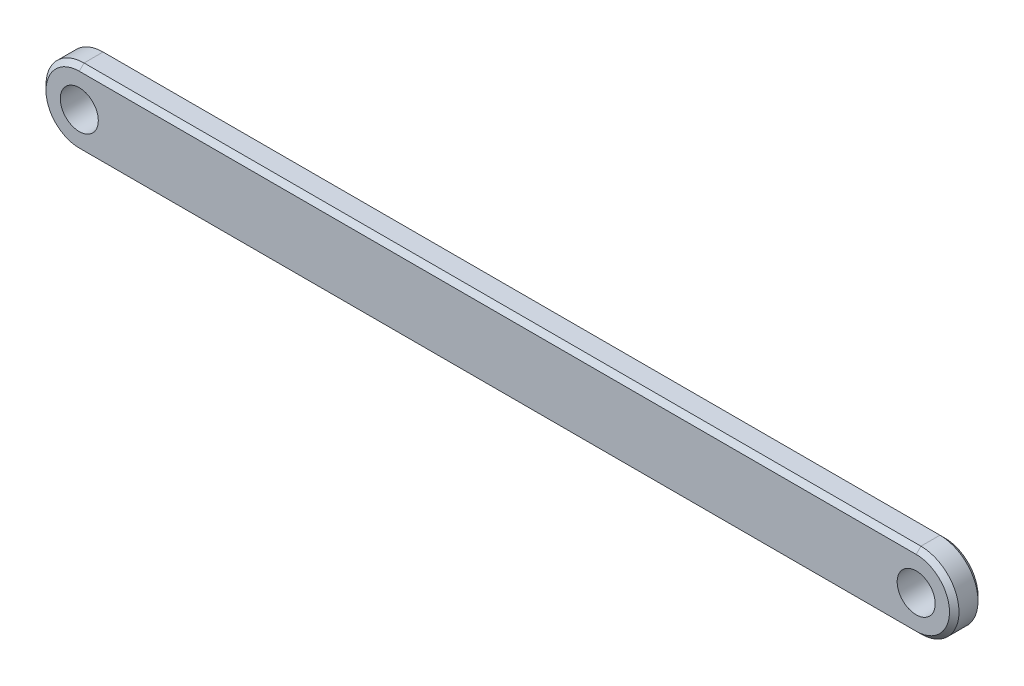
ISO-10303-21;
HEADER;
FILE_DESCRIPTION(('STEP AP214'),'2;1');
FILE_NAME('part.step','',(''),(''),'','','');
FILE_SCHEMA(('AUTOMOTIVE_DESIGN { 1 0 10303 214 1 1 1 1 }'));
ENDSEC;
DATA;
#1=APPLICATION_CONTEXT('core data for automotive mechanical design processes');
#2=APPLICATION_PROTOCOL_DEFINITION('international standard','automotive_design',2000,#1);
#3=PRODUCT_CONTEXT('',#1,'mechanical');
#4=PRODUCT('Part','Part','',(#3));
#5=PRODUCT_RELATED_PRODUCT_CATEGORY('part','',(#4));
#6=PRODUCT_DEFINITION_FORMATION('','',#4);
#7=PRODUCT_DEFINITION_CONTEXT('part definition',#1,'design');
#8=PRODUCT_DEFINITION('design','',#6,#7);
#9=PRODUCT_DEFINITION_SHAPE('','',#8);
#10=(LENGTH_UNIT() NAMED_UNIT(*) SI_UNIT(.MILLI.,.METRE.));
#11=(NAMED_UNIT(*) PLANE_ANGLE_UNIT() SI_UNIT($,.RADIAN.));
#12=(NAMED_UNIT(*) SI_UNIT($,.STERADIAN.) SOLID_ANGLE_UNIT());
#13=UNCERTAINTY_MEASURE_WITH_UNIT(LENGTH_MEASURE(1.E-05),#10,'distance_accuracy_value','');
#14=(GEOMETRIC_REPRESENTATION_CONTEXT(3) GLOBAL_UNCERTAINTY_ASSIGNED_CONTEXT((#13)) GLOBAL_UNIT_ASSIGNED_CONTEXT((#10,
#11,#12)) REPRESENTATION_CONTEXT('',''));
#15=CARTESIAN_POINT('',(0.,0.,0.));
#16=DIRECTION('',(0.,0.,1.));
#17=DIRECTION('',(1.,0.,0.));
#18=AXIS2_PLACEMENT_3D('',#15,#16,#17);
#19=CARTESIAN_POINT('',(-44.,0.,3.));
#20=DIRECTION('',(0.,0.,1.));
#21=DIRECTION('',(1.,0.,0.));
#22=AXIS2_PLACEMENT_3D('',#19,#20,#21);
#23=PLANE('',#22);
#24=DIRECTION('',(-1.,0.,0.));
#25=VECTOR('',#24,1.);
#26=CARTESIAN_POINT('',(-44.,3.5,3.));
#27=LINE('',#26,#25);
#28=CARTESIAN_POINT('',(44.,3.5,3.));
#29=VERTEX_POINT('',#28);
#30=CARTESIAN_POINT('',(-44.,3.5,3.));
#31=VERTEX_POINT('',#30);
#32=EDGE_CURVE('E55',#29,#31,#27,.T.);
#33=ORIENTED_EDGE('',*,*,#32,.T.);
#34=CARTESIAN_POINT('',(-44.,0.,3.));
#35=DIRECTION('',(0.,0.,1.));
#36=DIRECTION('',(1.,0.,0.));
#37=AXIS2_PLACEMENT_3D('',#34,#35,#36);
#38=CIRCLE('',#37,3.5);
#39=CARTESIAN_POINT('',(-44.,-3.5,3.));
#40=VERTEX_POINT('',#39);
#41=EDGE_CURVE('E11',#31,#40,#38,.T.);
#42=ORIENTED_EDGE('',*,*,#41,.T.);
#43=DIRECTION('',(1.,0.,0.));
#44=VECTOR('',#43,1.);
#45=CARTESIAN_POINT('',(44.,-3.5,3.));
#46=LINE('',#45,#44);
#47=CARTESIAN_POINT('',(44.,-3.5,3.));
#48=VERTEX_POINT('',#47);
#49=EDGE_CURVE('E145',#40,#48,#46,.T.);
#50=ORIENTED_EDGE('',*,*,#49,.T.);
#51=CARTESIAN_POINT('',(44.,0.,3.));
#52=DIRECTION('',(0.,0.,1.));
#53=DIRECTION('',(1.,0.,0.));
#54=AXIS2_PLACEMENT_3D('',#51,#52,#53);
#55=CIRCLE('',#54,3.5);
#56=EDGE_CURVE('E66',#48,#29,#55,.T.);
#57=ORIENTED_EDGE('',*,*,#56,.T.);
#58=EDGE_LOOP('',(#33,#42,#50,#57));
#59=FACE_BOUND('',#58,.T.);
#60=CARTESIAN_POINT('',(-44.,0.,3.));
#61=DIRECTION('',(0.,0.,1.));
#62=DIRECTION('',(1.,0.,0.));
#63=AXIS2_PLACEMENT_3D('',#60,#61,#62);
#64=CIRCLE('',#63,2.);
#65=CARTESIAN_POINT('',(-42.,0.,3.));
#66=VERTEX_POINT('',#65);
#67=EDGE_CURVE('E183',#66,#66,#64,.T.);
#68=ORIENTED_EDGE('',*,*,#67,.F.);
#69=EDGE_LOOP('',(#68));
#70=FACE_BOUND('',#69,.T.);
#71=CARTESIAN_POINT('',(44.,0.,3.));
#72=DIRECTION('',(0.,0.,1.));
#73=DIRECTION('',(1.,0.,0.));
#74=AXIS2_PLACEMENT_3D('',#71,#72,#73);
#75=CIRCLE('',#74,2.);
#76=CARTESIAN_POINT('',(46.,0.,3.));
#77=VERTEX_POINT('',#76);
#78=EDGE_CURVE('E175',#77,#77,#75,.T.);
#79=ORIENTED_EDGE('',*,*,#78,.F.);
#80=EDGE_LOOP('',(#79));
#81=FACE_BOUND('',#80,.T.);
#82=ADVANCED_FACE('F45',(#59,#70,#81),#23,.T.);
#83=CARTESIAN_POINT('',(-44.,0.,0.));
#84=DIRECTION('',(0.,0.,1.));
#85=DIRECTION('',(1.,0.,0.));
#86=AXIS2_PLACEMENT_3D('',#83,#84,#85);
#87=PLANE('',#86);
#88=DIRECTION('',(-1.,0.,0.));
#89=VECTOR('',#88,1.);
#90=CARTESIAN_POINT('',(-44.,-3.5,0.));
#91=LINE('',#90,#89);
#92=CARTESIAN_POINT('',(44.,-3.5,0.));
#93=VERTEX_POINT('',#92);
#94=CARTESIAN_POINT('',(-44.,-3.5,0.));
#95=VERTEX_POINT('',#94);
#96=EDGE_CURVE('E199',#93,#95,#91,.T.);
#97=ORIENTED_EDGE('',*,*,#96,.T.);
#98=CARTESIAN_POINT('',(-44.,0.,0.));
#99=DIRECTION('',(0.,0.,1.));
#100=DIRECTION('',(1.,0.,0.));
#101=AXIS2_PLACEMENT_3D('',#98,#99,#100);
#102=CIRCLE('',#101,3.5);
#103=CARTESIAN_POINT('',(-44.,3.5,0.));
#104=VERTEX_POINT('',#103);
#105=EDGE_CURVE('E123',#95,#104,#102,.F.);
#106=ORIENTED_EDGE('',*,*,#105,.T.);
#107=DIRECTION('',(1.,0.,0.));
#108=VECTOR('',#107,1.);
#109=CARTESIAN_POINT('',(-44.,3.5,0.));
#110=LINE('',#109,#108);
#111=CARTESIAN_POINT('',(44.,3.5,0.));
#112=VERTEX_POINT('',#111);
#113=EDGE_CURVE('E195',#104,#112,#110,.T.);
#114=ORIENTED_EDGE('',*,*,#113,.T.);
#115=CARTESIAN_POINT('',(44.,0.,0.));
#116=DIRECTION('',(0.,0.,1.));
#117=DIRECTION('',(1.,0.,0.));
#118=AXIS2_PLACEMENT_3D('',#115,#116,#117);
#119=CIRCLE('',#118,3.5);
#120=EDGE_CURVE('E197',#112,#93,#119,.F.);
#121=ORIENTED_EDGE('',*,*,#120,.T.);
#122=EDGE_LOOP('',(#97,#106,#114,#121));
#123=FACE_BOUND('',#122,.T.);
#124=CARTESIAN_POINT('',(-44.,0.,0.));
#125=DIRECTION('',(0.,0.,1.));
#126=DIRECTION('',(1.,0.,0.));
#127=AXIS2_PLACEMENT_3D('',#124,#125,#126);
#128=CIRCLE('',#127,2.);
#129=CARTESIAN_POINT('',(-42.,0.,0.));
#130=VERTEX_POINT('',#129);
#131=EDGE_CURVE('E180',#130,#130,#128,.T.);
#132=ORIENTED_EDGE('',*,*,#131,.T.);
#133=EDGE_LOOP('',(#132));
#134=FACE_BOUND('',#133,.T.);
#135=CARTESIAN_POINT('',(44.,0.,0.));
#136=DIRECTION('',(0.,0.,1.));
#137=DIRECTION('',(1.,0.,0.));
#138=AXIS2_PLACEMENT_3D('',#135,#136,#137);
#139=CIRCLE('',#138,2.);
#140=CARTESIAN_POINT('',(46.,0.,0.));
#141=VERTEX_POINT('',#140);
#142=EDGE_CURVE('E169',#141,#141,#139,.T.);
#143=ORIENTED_EDGE('',*,*,#142,.T.);
#144=EDGE_LOOP('',(#143));
#145=FACE_BOUND('',#144,.T.);
#146=ADVANCED_FACE('F240',(#123,#134,#145),#87,.F.);
#147=CARTESIAN_POINT('',(-44.,0.,3.));
#148=DIRECTION('',(0.,0.,-1.));
#149=DIRECTION('',(-1.,0.,0.));
#150=AXIS2_PLACEMENT_3D('',#147,#148,#149);
#151=CYLINDRICAL_SURFACE('',#150,4.);
#152=DIRECTION('',(0.,0.,-1.));
#153=VECTOR('',#152,1.);
#154=CARTESIAN_POINT('',(-44.,4.,3.));
#155=LINE('',#154,#153);
#156=CARTESIAN_POINT('',(-44.,4.,2.5));
#157=VERTEX_POINT('',#156);
#158=CARTESIAN_POINT('',(-44.,4.,0.5));
#159=VERTEX_POINT('',#158);
#160=EDGE_CURVE('E186',#157,#159,#155,.T.);
#161=ORIENTED_EDGE('',*,*,#160,.T.);
#162=CARTESIAN_POINT('',(-44.,0.,0.5));
#163=DIRECTION('',(0.,0.,1.));
#164=DIRECTION('',(1.,0.,0.));
#165=AXIS2_PLACEMENT_3D('',#162,#163,#164);
#166=CIRCLE('',#165,4.);
#167=CARTESIAN_POINT('',(-44.,-4.,0.5));
#168=VERTEX_POINT('',#167);
#169=EDGE_CURVE('E134',#159,#168,#166,.T.);
#170=ORIENTED_EDGE('',*,*,#169,.T.);
#171=DIRECTION('',(0.,0.,-1.));
#172=VECTOR('',#171,1.);
#173=CARTESIAN_POINT('',(-44.,-4.,3.));
#174=LINE('',#173,#172);
#175=CARTESIAN_POINT('',(-44.,-4.,2.5));
#176=VERTEX_POINT('',#175);
#177=EDGE_CURVE('E115',#176,#168,#174,.T.);
#178=ORIENTED_EDGE('',*,*,#177,.F.);
#179=CARTESIAN_POINT('',(-44.,0.,2.5));
#180=DIRECTION('',(0.,0.,1.));
#181=DIRECTION('',(1.,0.,0.));
#182=AXIS2_PLACEMENT_3D('',#179,#180,#181);
#183=CIRCLE('',#182,4.);
#184=EDGE_CURVE('E131',#176,#157,#183,.F.);
#185=ORIENTED_EDGE('',*,*,#184,.T.);
#186=EDGE_LOOP('',(#161,#170,#178,#185));
#187=FACE_BOUND('',#186,.T.);
#188=ADVANCED_FACE('F130',(#187),#151,.T.);
#189=CARTESIAN_POINT('',(-44.,-4.,3.));
#190=DIRECTION('',(0.,1.,0.));
#191=DIRECTION('',(0.,0.,1.));
#192=AXIS2_PLACEMENT_3D('',#189,#190,#191);
#193=PLANE('',#192);
#194=ORIENTED_EDGE('',*,*,#177,.T.);
#195=DIRECTION('',(1.,0.,0.));
#196=VECTOR('',#195,1.);
#197=CARTESIAN_POINT('',(-44.,-4.,0.5));
#198=LINE('',#197,#196);
#199=CARTESIAN_POINT('',(44.,-4.,0.5));
#200=VERTEX_POINT('',#199);
#201=EDGE_CURVE('E122',#168,#200,#198,.T.);
#202=ORIENTED_EDGE('',*,*,#201,.T.);
#203=DIRECTION('',(0.,0.,-1.));
#204=VECTOR('',#203,1.);
#205=CARTESIAN_POINT('',(44.,-4.,3.));
#206=LINE('',#205,#204);
#207=CARTESIAN_POINT('',(44.,-4.,2.5));
#208=VERTEX_POINT('',#207);
#209=EDGE_CURVE('E117',#208,#200,#206,.T.);
#210=ORIENTED_EDGE('',*,*,#209,.F.);
#211=DIRECTION('',(-1.,0.,0.));
#212=VECTOR('',#211,1.);
#213=CARTESIAN_POINT('',(-44.,-4.,2.5));
#214=LINE('',#213,#212);
#215=EDGE_CURVE('E112',#208,#176,#214,.T.);
#216=ORIENTED_EDGE('',*,*,#215,.T.);
#217=EDGE_LOOP('',(#194,#202,#210,#216));
#218=FACE_BOUND('',#217,.T.);
#219=ADVANCED_FACE('F114',(#218),#193,.F.);
#220=CARTESIAN_POINT('',(44.,0.,3.));
#221=DIRECTION('',(0.,0.,-1.));
#222=DIRECTION('',(-1.,0.,0.));
#223=AXIS2_PLACEMENT_3D('',#220,#221,#222);
#224=CYLINDRICAL_SURFACE('',#223,4.);
#225=ORIENTED_EDGE('',*,*,#209,.T.);
#226=CARTESIAN_POINT('',(44.,0.,0.5));
#227=DIRECTION('',(0.,0.,1.));
#228=DIRECTION('',(1.,0.,0.));
#229=AXIS2_PLACEMENT_3D('',#226,#227,#228);
#230=CIRCLE('',#229,4.);
#231=CARTESIAN_POINT('',(44.,4.,0.5));
#232=VERTEX_POINT('',#231);
#233=EDGE_CURVE('E206',#200,#232,#230,.T.);
#234=ORIENTED_EDGE('',*,*,#233,.T.);
#235=DIRECTION('',(0.,0.,-1.));
#236=VECTOR('',#235,1.);
#237=CARTESIAN_POINT('',(44.,4.,3.));
#238=LINE('',#237,#236);
#239=CARTESIAN_POINT('',(44.,4.,2.5));
#240=VERTEX_POINT('',#239);
#241=EDGE_CURVE('E190',#240,#232,#238,.T.);
#242=ORIENTED_EDGE('',*,*,#241,.F.);
#243=CARTESIAN_POINT('',(44.,0.,2.5));
#244=DIRECTION('',(0.,0.,1.));
#245=DIRECTION('',(1.,0.,0.));
#246=AXIS2_PLACEMENT_3D('',#243,#244,#245);
#247=CIRCLE('',#246,4.);
#248=EDGE_CURVE('E204',#240,#208,#247,.F.);
#249=ORIENTED_EDGE('',*,*,#248,.T.);
#250=EDGE_LOOP('',(#225,#234,#242,#249));
#251=FACE_BOUND('',#250,.T.);
#252=ADVANCED_FACE('F221',(#251),#224,.T.);
#253=CARTESIAN_POINT('',(-44.,4.,3.));
#254=DIRECTION('',(0.,-1.,0.));
#255=DIRECTION('',(0.,0.,-1.));
#256=AXIS2_PLACEMENT_3D('',#253,#254,#255);
#257=PLANE('',#256);
#258=ORIENTED_EDGE('',*,*,#241,.T.);
#259=DIRECTION('',(-1.,0.,0.));
#260=VECTOR('',#259,1.);
#261=CARTESIAN_POINT('',(-44.,4.,0.5));
#262=LINE('',#261,#260);
#263=EDGE_CURVE('E210',#232,#159,#262,.T.);
#264=ORIENTED_EDGE('',*,*,#263,.T.);
#265=ORIENTED_EDGE('',*,*,#160,.F.);
#266=DIRECTION('',(1.,0.,0.));
#267=VECTOR('',#266,1.);
#268=CARTESIAN_POINT('',(44.,4.,2.5));
#269=LINE('',#268,#267);
#270=EDGE_CURVE('E208',#157,#240,#269,.T.);
#271=ORIENTED_EDGE('',*,*,#270,.T.);
#272=EDGE_LOOP('',(#258,#264,#265,#271));
#273=FACE_BOUND('',#272,.T.);
#274=ADVANCED_FACE('F219',(#273),#257,.F.);
#275=CARTESIAN_POINT('',(-44.,0.,3.));
#276=DIRECTION('',(0.,0.,-1.));
#277=DIRECTION('',(-1.,0.,0.));
#278=AXIS2_PLACEMENT_3D('',#275,#276,#277);
#279=CYLINDRICAL_SURFACE('',#278,2.);
#280=ORIENTED_EDGE('',*,*,#67,.T.);
#281=EDGE_LOOP('',(#280));
#282=FACE_BOUND('',#281,.T.);
#283=ORIENTED_EDGE('',*,*,#131,.F.);
#284=EDGE_LOOP('',(#283));
#285=FACE_BOUND('',#284,.T.);
#286=ADVANCED_FACE('F248',(#282,#285),#279,.F.);
#287=CARTESIAN_POINT('',(44.,0.,3.));
#288=DIRECTION('',(0.,0.,-1.));
#289=DIRECTION('',(-1.,0.,0.));
#290=AXIS2_PLACEMENT_3D('',#287,#288,#289);
#291=CYLINDRICAL_SURFACE('',#290,2.);
#292=ORIENTED_EDGE('',*,*,#78,.T.);
#293=EDGE_LOOP('',(#292));
#294=FACE_BOUND('',#293,.T.);
#295=ORIENTED_EDGE('',*,*,#142,.F.);
#296=EDGE_LOOP('',(#295));
#297=FACE_BOUND('',#296,.T.);
#298=ADVANCED_FACE('F279',(#294,#297),#291,.F.);
#299=CARTESIAN_POINT('',(44.,0.,0.5));
#300=DIRECTION('',(0.,0.,1.));
#301=DIRECTION('',(1.,0.,0.));
#302=AXIS2_PLACEMENT_3D('',#299,#300,#301);
#303=CONICAL_SURFACE('',#302,4.,0.785398163397448);
#304=DIRECTION('',(0.,-0.707106781186547,0.707106781186547));
#305=VECTOR('',#304,1.);
#306=CARTESIAN_POINT('',(44.,-3.5,0.));
#307=LINE('',#306,#305);
#308=EDGE_CURVE('E161',#93,#200,#307,.T.);
#309=ORIENTED_EDGE('',*,*,#308,.F.);
#310=ORIENTED_EDGE('',*,*,#120,.F.);
#311=DIRECTION('',(0.,-0.707106781186547,-0.707106781186547));
#312=VECTOR('',#311,1.);
#313=CARTESIAN_POINT('',(44.,4.,0.5));
#314=LINE('',#313,#312);
#315=EDGE_CURVE('E150',#232,#112,#314,.T.);
#316=ORIENTED_EDGE('',*,*,#315,.F.);
#317=ORIENTED_EDGE('',*,*,#233,.F.);
#318=EDGE_LOOP('',(#309,#310,#316,#317));
#319=FACE_BOUND('',#318,.T.);
#320=ADVANCED_FACE('F224',(#319),#303,.T.);
#321=CARTESIAN_POINT('',(-44.,4.,0.5));
#322=DIRECTION('',(0.,-0.707106781186547,0.707106781186547));
#323=DIRECTION('',(-1.,0.,0.));
#324=AXIS2_PLACEMENT_3D('',#321,#322,#323);
#325=PLANE('',#324);
#326=ORIENTED_EDGE('',*,*,#315,.T.);
#327=ORIENTED_EDGE('',*,*,#113,.F.);
#328=DIRECTION('',(0.,-0.707106781186547,-0.707106781186547));
#329=VECTOR('',#328,1.);
#330=CARTESIAN_POINT('',(-44.,4.,0.5));
#331=LINE('',#330,#329);
#332=EDGE_CURVE('E155',#159,#104,#331,.T.);
#333=ORIENTED_EDGE('',*,*,#332,.F.);
#334=ORIENTED_EDGE('',*,*,#263,.F.);
#335=EDGE_LOOP('',(#326,#327,#333,#334));
#336=FACE_BOUND('',#335,.T.);
#337=ADVANCED_FACE('F227',(#336),#325,.F.);
#338=CARTESIAN_POINT('',(-44.,-4.,0.5));
#339=DIRECTION('',(0.,0.707106781186547,0.707106781186547));
#340=DIRECTION('',(1.,0.,0.));
#341=AXIS2_PLACEMENT_3D('',#338,#339,#340);
#342=PLANE('',#341);
#343=ORIENTED_EDGE('',*,*,#308,.T.);
#344=ORIENTED_EDGE('',*,*,#201,.F.);
#345=DIRECTION('',(0.,-0.707106781186547,0.707106781186547));
#346=VECTOR('',#345,1.);
#347=CARTESIAN_POINT('',(-44.,-3.5,0.));
#348=LINE('',#347,#346);
#349=EDGE_CURVE('E153',#95,#168,#348,.T.);
#350=ORIENTED_EDGE('',*,*,#349,.F.);
#351=ORIENTED_EDGE('',*,*,#96,.F.);
#352=EDGE_LOOP('',(#343,#344,#350,#351));
#353=FACE_BOUND('',#352,.T.);
#354=ADVANCED_FACE('F230',(#353),#342,.F.);
#355=CARTESIAN_POINT('',(-44.,0.,0.5));
#356=DIRECTION('',(0.,0.,1.));
#357=DIRECTION('',(1.,0.,0.));
#358=AXIS2_PLACEMENT_3D('',#355,#356,#357);
#359=CONICAL_SURFACE('',#358,4.,0.785398163397448);
#360=ORIENTED_EDGE('',*,*,#332,.T.);
#361=ORIENTED_EDGE('',*,*,#105,.F.);
#362=ORIENTED_EDGE('',*,*,#349,.T.);
#363=ORIENTED_EDGE('',*,*,#169,.F.);
#364=EDGE_LOOP('',(#360,#361,#362,#363));
#365=FACE_BOUND('',#364,.T.);
#366=ADVANCED_FACE('F228',(#365),#359,.T.);
#367=CARTESIAN_POINT('',(44.,0.,3.));
#368=DIRECTION('',(0.,0.,-1.));
#369=DIRECTION('',(-1.,0.,0.));
#370=AXIS2_PLACEMENT_3D('',#367,#368,#369);
#371=CONICAL_SURFACE('',#370,3.5,0.785398163397448);
#372=DIRECTION('',(0.,0.707106781186547,0.707106781186547));
#373=VECTOR('',#372,1.);
#374=CARTESIAN_POINT('',(44.,-4.,2.5));
#375=LINE('',#374,#373);
#376=EDGE_CURVE('E147',#208,#48,#375,.T.);
#377=ORIENTED_EDGE('',*,*,#376,.F.);
#378=ORIENTED_EDGE('',*,*,#248,.F.);
#379=DIRECTION('',(0.,0.707106781186547,-0.707106781186547));
#380=VECTOR('',#379,1.);
#381=CARTESIAN_POINT('',(44.,3.5,3.));
#382=LINE('',#381,#380);
#383=EDGE_CURVE('E50',#29,#240,#382,.T.);
#384=ORIENTED_EDGE('',*,*,#383,.F.);
#385=ORIENTED_EDGE('',*,*,#56,.F.);
#386=EDGE_LOOP('',(#377,#378,#384,#385));
#387=FACE_BOUND('',#386,.T.);
#388=ADVANCED_FACE('F48',(#387),#371,.T.);
#389=CARTESIAN_POINT('',(-44.,3.5,3.));
#390=DIRECTION('',(0.,0.707106781186547,0.707106781186547));
#391=DIRECTION('',(1.,0.,0.));
#392=AXIS2_PLACEMENT_3D('',#389,#390,#391);
#393=PLANE('',#392);
#394=ORIENTED_EDGE('',*,*,#383,.T.);
#395=ORIENTED_EDGE('',*,*,#270,.F.);
#396=DIRECTION('',(0.,0.707106781186547,-0.707106781186547));
#397=VECTOR('',#396,1.);
#398=CARTESIAN_POINT('',(-44.,3.5,3.));
#399=LINE('',#398,#397);
#400=EDGE_CURVE('E141',#31,#157,#399,.T.);
#401=ORIENTED_EDGE('',*,*,#400,.F.);
#402=ORIENTED_EDGE('',*,*,#32,.F.);
#403=EDGE_LOOP('',(#394,#395,#401,#402));
#404=FACE_BOUND('',#403,.T.);
#405=ADVANCED_FACE('F216',(#404),#393,.T.);
#406=CARTESIAN_POINT('',(-44.,-3.5,3.));
#407=DIRECTION('',(0.,-0.707106781186547,0.707106781186547));
#408=DIRECTION('',(-1.,0.,0.));
#409=AXIS2_PLACEMENT_3D('',#406,#407,#408);
#410=PLANE('',#409);
#411=ORIENTED_EDGE('',*,*,#376,.T.);
#412=ORIENTED_EDGE('',*,*,#49,.F.);
#413=DIRECTION('',(0.,0.707106781186547,0.707106781186547));
#414=VECTOR('',#413,1.);
#415=CARTESIAN_POINT('',(-44.,-4.,2.5));
#416=LINE('',#415,#414);
#417=EDGE_CURVE('E139',#176,#40,#416,.T.);
#418=ORIENTED_EDGE('',*,*,#417,.F.);
#419=ORIENTED_EDGE('',*,*,#215,.F.);
#420=EDGE_LOOP('',(#411,#412,#418,#419));
#421=FACE_BOUND('',#420,.T.);
#422=ADVANCED_FACE('F144',(#421),#410,.T.);
#423=CARTESIAN_POINT('',(-44.,0.,3.));
#424=DIRECTION('',(0.,0.,-1.));
#425=DIRECTION('',(-1.,0.,0.));
#426=AXIS2_PLACEMENT_3D('',#423,#424,#425);
#427=CONICAL_SURFACE('',#426,3.5,0.785398163397448);
#428=ORIENTED_EDGE('',*,*,#400,.T.);
#429=ORIENTED_EDGE('',*,*,#184,.F.);
#430=ORIENTED_EDGE('',*,*,#417,.T.);
#431=ORIENTED_EDGE('',*,*,#41,.F.);
#432=EDGE_LOOP('',(#428,#429,#430,#431));
#433=FACE_BOUND('',#432,.T.);
#434=ADVANCED_FACE('F137',(#433),#427,.T.);
#435=CLOSED_SHELL('',(#82,#146,#188,#219,#252,#274,#286,#298,#320,#337,#354,#366,#388,#405,#422,#434));
#436=MANIFOLD_SOLID_BREP('B2',#435);
#437=ADVANCED_BREP_SHAPE_REPRESENTATION('',(#18,#436),#14);
#438=SHAPE_DEFINITION_REPRESENTATION(#9,#437);
ENDSEC;
END-ISO-10303-21;
